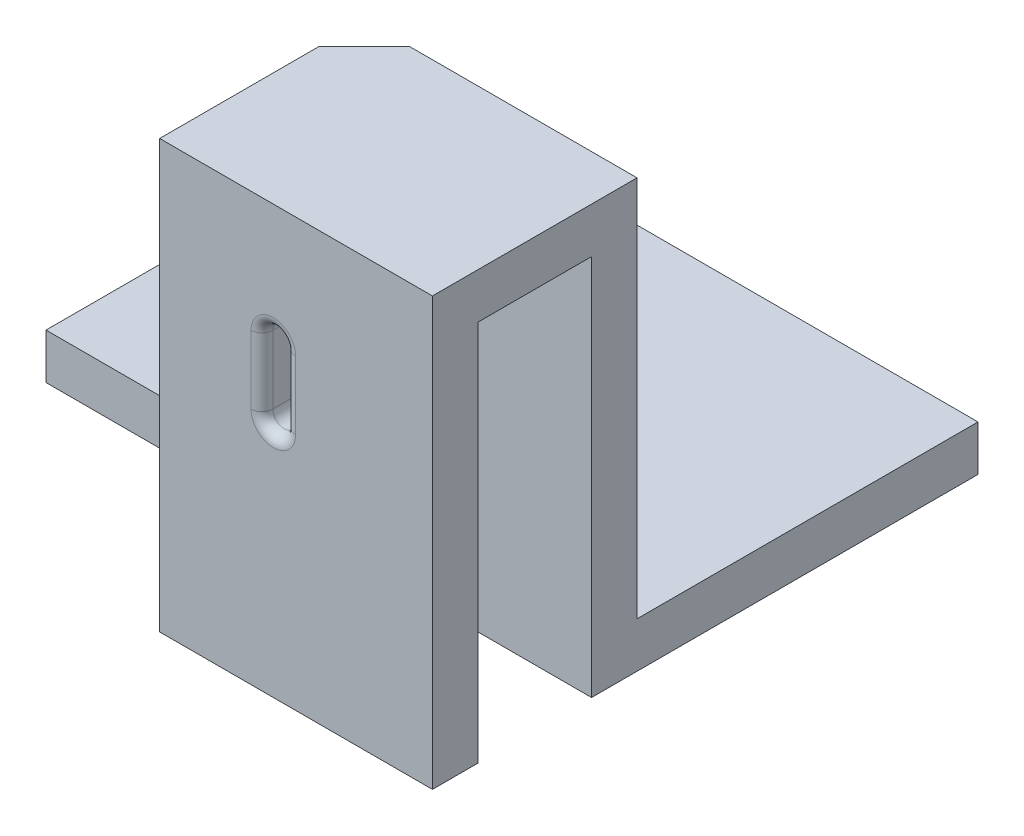
ISO-10303-21;
HEADER;
FILE_DESCRIPTION(('STEP AP214'),'2;1');
FILE_NAME('part.step','',(''),(''),'','','');
FILE_SCHEMA(('AUTOMOTIVE_DESIGN { 1 0 10303 214 1 1 1 1 }'));
ENDSEC;
DATA;
#1=APPLICATION_CONTEXT('core data for automotive mechanical design processes');
#2=APPLICATION_PROTOCOL_DEFINITION('international standard','automotive_design',2000,#1);
#3=PRODUCT_CONTEXT('',#1,'mechanical');
#4=PRODUCT('Part','Part','',(#3));
#5=PRODUCT_RELATED_PRODUCT_CATEGORY('part','',(#4));
#6=PRODUCT_DEFINITION_FORMATION('','',#4);
#7=PRODUCT_DEFINITION_CONTEXT('part definition',#1,'design');
#8=PRODUCT_DEFINITION('design','',#6,#7);
#9=PRODUCT_DEFINITION_SHAPE('','',#8);
#10=(LENGTH_UNIT() NAMED_UNIT(*) SI_UNIT(.MILLI.,.METRE.));
#11=(NAMED_UNIT(*) PLANE_ANGLE_UNIT() SI_UNIT($,.RADIAN.));
#12=(NAMED_UNIT(*) SI_UNIT($,.STERADIAN.) SOLID_ANGLE_UNIT());
#13=UNCERTAINTY_MEASURE_WITH_UNIT(LENGTH_MEASURE(1.E-05),#10,'distance_accuracy_value','');
#14=(GEOMETRIC_REPRESENTATION_CONTEXT(3) GLOBAL_UNCERTAINTY_ASSIGNED_CONTEXT((#13)) GLOBAL_UNIT_ASSIGNED_CONTEXT((#10,
#11,#12)) REPRESENTATION_CONTEXT('',''));
#15=CARTESIAN_POINT('',(0.,0.,0.));
#16=DIRECTION('',(0.,0.,1.));
#17=DIRECTION('',(1.,0.,0.));
#18=AXIS2_PLACEMENT_3D('',#15,#16,#17);
#19=CARTESIAN_POINT('',(0.,0.,0.));
#20=DIRECTION('',(0.,-1.,0.));
#21=DIRECTION('',(0.,0.,-1.));
#22=AXIS2_PLACEMENT_3D('',#19,#20,#21);
#23=PLANE('',#22);
#24=DIRECTION('',(-1.,0.,0.));
#25=VECTOR('',#24,1.);
#26=CARTESIAN_POINT('',(19.05,0.,-11.1125));
#27=LINE('',#26,#25);
#28=CARTESIAN_POINT('',(38.1,0.,-11.1125));
#29=VERTEX_POINT('',#28);
#30=CARTESIAN_POINT('',(0.,0.,-11.1125));
#31=VERTEX_POINT('',#30);
#32=EDGE_CURVE('E323',#29,#31,#27,.T.);
#33=ORIENTED_EDGE('',*,*,#32,.T.);
#34=DIRECTION('',(0.,0.,1.));
#35=VECTOR('',#34,1.);
#36=CARTESIAN_POINT('',(0.,0.,0.));
#37=LINE('',#36,#35);
#38=CARTESIAN_POINT('',(0.,0.,-38.1));
#39=VERTEX_POINT('',#38);
#40=EDGE_CURVE('E206',#39,#31,#37,.T.);
#41=ORIENTED_EDGE('',*,*,#40,.F.);
#42=DIRECTION('',(-1.,0.,0.));
#43=VECTOR('',#42,1.);
#44=CARTESIAN_POINT('',(0.,0.,-38.1));
#45=LINE('',#44,#43);
#46=CARTESIAN_POINT('',(38.1,0.,-38.1));
#47=VERTEX_POINT('',#46);
#48=EDGE_CURVE('E214',#47,#39,#45,.T.);
#49=ORIENTED_EDGE('',*,*,#48,.F.);
#50=DIRECTION('',(0.,0.,-1.));
#51=VECTOR('',#50,1.);
#52=CARTESIAN_POINT('',(38.1,0.,0.));
#53=LINE('',#52,#51);
#54=EDGE_CURVE('E205',#29,#47,#53,.T.);
#55=ORIENTED_EDGE('',*,*,#54,.F.);
#56=EDGE_LOOP('',(#33,#41,#49,#55));
#57=FACE_BOUND('',#56,.T.);
#58=ADVANCED_FACE('F35',(#57),#23,.T.);
#59=CARTESIAN_POINT('',(0.,3.175,0.));
#60=DIRECTION('',(0.,-1.,0.));
#61=DIRECTION('',(0.,0.,-1.));
#62=AXIS2_PLACEMENT_3D('',#59,#60,#61);
#63=PLANE('',#62);
#64=DIRECTION('',(0.,0.,1.));
#65=VECTOR('',#64,1.);
#66=CARTESIAN_POINT('',(0.,3.175,0.));
#67=LINE('',#66,#65);
#68=CARTESIAN_POINT('',(0.,3.175,-38.1));
#69=VERTEX_POINT('',#68);
#70=CARTESIAN_POINT('',(0.,3.175,-11.1125));
#71=VERTEX_POINT('',#70);
#72=EDGE_CURVE('E217',#69,#71,#67,.T.);
#73=ORIENTED_EDGE('',*,*,#72,.T.);
#74=DIRECTION('',(-1.,0.,0.));
#75=VECTOR('',#74,1.);
#76=CARTESIAN_POINT('',(19.05,3.175,-11.1125));
#77=LINE('',#76,#75);
#78=CARTESIAN_POINT('',(22.225,3.175,-11.1125));
#79=VERTEX_POINT('',#78);
#80=EDGE_CURVE('E319',#79,#71,#77,.T.);
#81=ORIENTED_EDGE('',*,*,#80,.F.);
#82=DIRECTION('',(0.,0.,1.));
#83=VECTOR('',#82,1.);
#84=CARTESIAN_POINT('',(22.225,3.175,0.));
#85=LINE('',#84,#83);
#86=CARTESIAN_POINT('',(22.225,3.175,-14.2875));
#87=VERTEX_POINT('',#86);
#88=EDGE_CURVE('E354',#87,#79,#85,.T.);
#89=ORIENTED_EDGE('',*,*,#88,.F.);
#90=DIRECTION('',(-1.,0.,0.));
#91=VECTOR('',#90,1.);
#92=CARTESIAN_POINT('',(0.,3.175,-14.2875));
#93=LINE('',#92,#91);
#94=CARTESIAN_POINT('',(38.1,3.175,-14.2875));
#95=VERTEX_POINT('',#94);
#96=EDGE_CURVE('E349',#95,#87,#93,.T.);
#97=ORIENTED_EDGE('',*,*,#96,.F.);
#98=DIRECTION('',(0.,0.,-1.));
#99=VECTOR('',#98,1.);
#100=CARTESIAN_POINT('',(38.1,3.175,0.));
#101=LINE('',#100,#99);
#102=CARTESIAN_POINT('',(38.1,3.175,-38.1));
#103=VERTEX_POINT('',#102);
#104=EDGE_CURVE('E378',#95,#103,#101,.T.);
#105=ORIENTED_EDGE('',*,*,#104,.T.);
#106=DIRECTION('',(-1.,0.,0.));
#107=VECTOR('',#106,1.);
#108=CARTESIAN_POINT('',(0.,3.175,-38.1));
#109=LINE('',#108,#107);
#110=EDGE_CURVE('E221',#103,#69,#109,.T.);
#111=ORIENTED_EDGE('',*,*,#110,.T.);
#112=EDGE_LOOP('',(#73,#81,#89,#97,#105,#111));
#113=FACE_BOUND('',#112,.T.);
#114=ADVANCED_FACE('F383',(#113),#63,.F.);
#115=CARTESIAN_POINT('',(0.,3.175,0.));
#116=DIRECTION('',(1.,0.,0.));
#117=DIRECTION('',(0.,0.,-1.));
#118=AXIS2_PLACEMENT_3D('',#115,#116,#117);
#119=PLANE('',#118);
#120=ORIENTED_EDGE('',*,*,#40,.T.);
#121=DIRECTION('',(0.,1.,0.));
#122=VECTOR('',#121,1.);
#123=CARTESIAN_POINT('',(0.,0.,-11.1125));
#124=LINE('',#123,#122);
#125=EDGE_CURVE('E199',#31,#71,#124,.T.);
#126=ORIENTED_EDGE('',*,*,#125,.T.);
#127=ORIENTED_EDGE('',*,*,#72,.F.);
#128=DIRECTION('',(0.,-1.,0.));
#129=VECTOR('',#128,1.);
#130=CARTESIAN_POINT('',(0.,3.175,-38.1));
#131=LINE('',#130,#129);
#132=EDGE_CURVE('E218',#69,#39,#131,.T.);
#133=ORIENTED_EDGE('',*,*,#132,.T.);
#134=EDGE_LOOP('',(#120,#126,#127,#133));
#135=FACE_BOUND('',#134,.T.);
#136=ADVANCED_FACE('F391',(#135),#119,.F.);
#137=CARTESIAN_POINT('',(0.,3.175,0.));
#138=DIRECTION('',(0.,0.,-1.));
#139=DIRECTION('',(-1.,0.,0.));
#140=AXIS2_PLACEMENT_3D('',#137,#138,#139);
#141=PLANE('',#140);
#142=DIRECTION('',(0.,1.,0.));
#143=VECTOR('',#142,1.);
#144=CARTESIAN_POINT('',(28.54325,3.175,0.));
#145=LINE('',#144,#143);
#146=CARTESIAN_POINT('',(28.54325,21.43125,0.));
#147=VERTEX_POINT('',#146);
#148=CARTESIAN_POINT('',(28.54325,16.66875,0.));
#149=VERTEX_POINT('',#148);
#150=EDGE_CURVE('E249',#147,#149,#145,.F.);
#151=ORIENTED_EDGE('',*,*,#150,.T.);
#152=CARTESIAN_POINT('',(26.9875,16.66875,0.));
#153=DIRECTION('',(0.,0.,-1.));
#154=DIRECTION('',(-1.,0.,0.));
#155=AXIS2_PLACEMENT_3D('',#152,#153,#154);
#156=CIRCLE('',#155,1.55575);
#157=CARTESIAN_POINT('',(25.43175,16.66875,0.));
#158=VERTEX_POINT('',#157);
#159=EDGE_CURVE('E254',#149,#158,#156,.T.);
#160=ORIENTED_EDGE('',*,*,#159,.T.);
#161=DIRECTION('',(0.,-1.,0.));
#162=VECTOR('',#161,1.);
#163=CARTESIAN_POINT('',(25.43175,3.175,0.));
#164=LINE('',#163,#162);
#165=CARTESIAN_POINT('',(25.43175,21.43125,0.));
#166=VERTEX_POINT('',#165);
#167=EDGE_CURVE('E59',#158,#166,#164,.F.);
#168=ORIENTED_EDGE('',*,*,#167,.T.);
#169=CARTESIAN_POINT('',(26.9875,21.43125,0.));
#170=DIRECTION('',(0.,0.,-1.));
#171=DIRECTION('',(-1.,0.,0.));
#172=AXIS2_PLACEMENT_3D('',#169,#170,#171);
#173=CIRCLE('',#172,1.55575);
#174=EDGE_CURVE('E251',#166,#147,#173,.T.);
#175=ORIENTED_EDGE('',*,*,#174,.T.);
#176=EDGE_LOOP('',(#151,#160,#168,#175));
#177=FACE_BOUND('',#176,.T.);
#178=DIRECTION('',(0.,-1.,0.));
#179=VECTOR('',#178,1.);
#180=CARTESIAN_POINT('',(19.05,26.67,0.));
#181=LINE('',#180,#179);
#182=CARTESIAN_POINT('',(19.05,29.845,0.));
#183=VERTEX_POINT('',#182);
#184=CARTESIAN_POINT('',(19.05,0.,0.));
#185=VERTEX_POINT('',#184);
#186=EDGE_CURVE('E178',#183,#185,#181,.T.);
#187=ORIENTED_EDGE('',*,*,#186,.T.);
#188=DIRECTION('',(1.,0.,0.));
#189=VECTOR('',#188,1.);
#190=CARTESIAN_POINT('',(0.,0.,0.));
#191=LINE('',#190,#189);
#192=CARTESIAN_POINT('',(38.1,0.,0.));
#193=VERTEX_POINT('',#192);
#194=EDGE_CURVE('E182',#185,#193,#191,.T.);
#195=ORIENTED_EDGE('',*,*,#194,.T.);
#196=DIRECTION('',(0.,-1.,0.));
#197=VECTOR('',#196,1.);
#198=CARTESIAN_POINT('',(38.1,3.175,0.));
#199=LINE('',#198,#197);
#200=CARTESIAN_POINT('',(38.1,29.845,0.));
#201=VERTEX_POINT('',#200);
#202=EDGE_CURVE('E224',#201,#193,#199,.T.);
#203=ORIENTED_EDGE('',*,*,#202,.F.);
#204=DIRECTION('',(1.,0.,0.));
#205=VECTOR('',#204,1.);
#206=CARTESIAN_POINT('',(19.05,29.845,0.));
#207=LINE('',#206,#205);
#208=EDGE_CURVE('E185',#183,#201,#207,.T.);
#209=ORIENTED_EDGE('',*,*,#208,.F.);
#210=EDGE_LOOP('',(#187,#195,#203,#209));
#211=FACE_BOUND('',#210,.T.);
#212=ADVANCED_FACE('F180',(#177,#211),#141,.F.);
#213=CARTESIAN_POINT('',(38.1,3.175,0.));
#214=DIRECTION('',(-1.,0.,0.));
#215=DIRECTION('',(0.,0.,1.));
#216=AXIS2_PLACEMENT_3D('',#213,#214,#215);
#217=PLANE('',#216);
#218=DIRECTION('',(0.,-1.,0.));
#219=VECTOR('',#218,1.);
#220=CARTESIAN_POINT('',(38.1,26.67,-11.1125));
#221=LINE('',#220,#219);
#222=CARTESIAN_POINT('',(38.1,26.67,-11.1125));
#223=VERTEX_POINT('',#222);
#224=EDGE_CURVE('E357',#223,#29,#221,.T.);
#225=ORIENTED_EDGE('',*,*,#224,.T.);
#226=ORIENTED_EDGE('',*,*,#54,.T.);
#227=DIRECTION('',(0.,-1.,0.));
#228=VECTOR('',#227,1.);
#229=CARTESIAN_POINT('',(38.1,3.175,-38.1));
#230=LINE('',#229,#228);
#231=EDGE_CURVE('E220',#103,#47,#230,.T.);
#232=ORIENTED_EDGE('',*,*,#231,.F.);
#233=ORIENTED_EDGE('',*,*,#104,.F.);
#234=DIRECTION('',(0.,-1.,0.));
#235=VECTOR('',#234,1.);
#236=CARTESIAN_POINT('',(38.1,26.67,-14.2875));
#237=LINE('',#236,#235);
#238=CARTESIAN_POINT('',(38.1,29.845,-14.2875));
#239=VERTEX_POINT('',#238);
#240=EDGE_CURVE('E369',#239,#95,#237,.T.);
#241=ORIENTED_EDGE('',*,*,#240,.F.);
#242=DIRECTION('',(0.,0.,-1.));
#243=VECTOR('',#242,1.);
#244=CARTESIAN_POINT('',(38.1,29.845,-14.2875));
#245=LINE('',#244,#243);
#246=EDGE_CURVE('E327',#201,#239,#245,.T.);
#247=ORIENTED_EDGE('',*,*,#246,.F.);
#248=ORIENTED_EDGE('',*,*,#202,.T.);
#249=CARTESIAN_POINT('',(38.1,0.,-3.175));
#250=VERTEX_POINT('',#249);
#251=EDGE_CURVE('E204',#193,#250,#53,.T.);
#252=ORIENTED_EDGE('',*,*,#251,.T.);
#253=DIRECTION('',(0.,-1.,0.));
#254=VECTOR('',#253,1.);
#255=CARTESIAN_POINT('',(38.1,26.67,-3.175));
#256=LINE('',#255,#254);
#257=CARTESIAN_POINT('',(38.1,26.67,-3.175));
#258=VERTEX_POINT('',#257);
#259=EDGE_CURVE('E210',#258,#250,#256,.T.);
#260=ORIENTED_EDGE('',*,*,#259,.F.);
#261=DIRECTION('',(0.,0.,-1.));
#262=VECTOR('',#261,1.);
#263=CARTESIAN_POINT('',(38.1,26.67,-14.2875));
#264=LINE('',#263,#262);
#265=EDGE_CURVE('E325',#258,#223,#264,.T.);
#266=ORIENTED_EDGE('',*,*,#265,.T.);
#267=EDGE_LOOP('',(#225,#226,#232,#233,#241,#247,#248,#252,#260,#266));
#268=FACE_BOUND('',#267,.T.);
#269=ADVANCED_FACE('F419',(#268),#217,.F.);
#270=CARTESIAN_POINT('',(0.,3.175,-38.1));
#271=DIRECTION('',(0.,0.,1.));
#272=DIRECTION('',(1.,0.,0.));
#273=AXIS2_PLACEMENT_3D('',#270,#271,#272);
#274=PLANE('',#273);
#275=ORIENTED_EDGE('',*,*,#132,.F.);
#276=ORIENTED_EDGE('',*,*,#110,.F.);
#277=ORIENTED_EDGE('',*,*,#231,.T.);
#278=ORIENTED_EDGE('',*,*,#48,.T.);
#279=EDGE_LOOP('',(#275,#276,#277,#278));
#280=FACE_BOUND('',#279,.T.);
#281=ADVANCED_FACE('F387',(#280),#274,.F.);
#282=DIRECTION('',(0.,0.,-1.));
#283=VECTOR('',#282,1.);
#284=CARTESIAN_POINT('',(19.05,0.,0.));
#285=LINE('',#284,#283);
#286=CARTESIAN_POINT('',(19.05,0.,-3.175));
#287=VERTEX_POINT('',#286);
#288=EDGE_CURVE('E193',#185,#287,#285,.T.);
#289=ORIENTED_EDGE('',*,*,#288,.T.);
#290=DIRECTION('',(1.,0.,0.));
#291=VECTOR('',#290,1.);
#292=CARTESIAN_POINT('',(19.05,0.,-3.175));
#293=LINE('',#292,#291);
#294=EDGE_CURVE('E321',#287,#250,#293,.T.);
#295=ORIENTED_EDGE('',*,*,#294,.T.);
#296=ORIENTED_EDGE('',*,*,#251,.F.);
#297=ORIENTED_EDGE('',*,*,#194,.F.);
#298=EDGE_LOOP('',(#289,#295,#296,#297));
#299=FACE_BOUND('',#298,.T.);
#300=ADVANCED_FACE('F202',(#299),#23,.T.);
#301=CARTESIAN_POINT('',(0.,26.67,-3.175));
#302=DIRECTION('',(0.,0.,1.));
#303=DIRECTION('',(1.,0.,0.));
#304=AXIS2_PLACEMENT_3D('',#301,#302,#303);
#305=PLANE('',#304);
#306=DIRECTION('',(0.,1.,0.));
#307=VECTOR('',#306,1.);
#308=CARTESIAN_POINT('',(25.43175,26.67,-3.175));
#309=LINE('',#308,#307);
#310=CARTESIAN_POINT('',(25.43175,21.43125,-3.175));
#311=VERTEX_POINT('',#310);
#312=CARTESIAN_POINT('',(25.43175,16.66875,-3.175));
#313=VERTEX_POINT('',#312);
#314=EDGE_CURVE('E232',#311,#313,#309,.F.);
#315=ORIENTED_EDGE('',*,*,#314,.T.);
#316=CARTESIAN_POINT('',(26.9875,16.66875,-3.175));
#317=DIRECTION('',(0.,0.,1.));
#318=DIRECTION('',(1.,0.,0.));
#319=AXIS2_PLACEMENT_3D('',#316,#317,#318);
#320=CIRCLE('',#319,1.55575);
#321=CARTESIAN_POINT('',(28.54325,16.66875,-3.175));
#322=VERTEX_POINT('',#321);
#323=EDGE_CURVE('E238',#313,#322,#320,.T.);
#324=ORIENTED_EDGE('',*,*,#323,.T.);
#325=DIRECTION('',(0.,-1.,0.));
#326=VECTOR('',#325,1.);
#327=CARTESIAN_POINT('',(28.54325,26.67,-3.175));
#328=LINE('',#327,#326);
#329=CARTESIAN_POINT('',(28.54325,21.43125,-3.175));
#330=VERTEX_POINT('',#329);
#331=EDGE_CURVE('E236',#322,#330,#328,.F.);
#332=ORIENTED_EDGE('',*,*,#331,.T.);
#333=CARTESIAN_POINT('',(26.9875,21.43125,-3.175));
#334=DIRECTION('',(0.,0.,1.));
#335=DIRECTION('',(1.,0.,0.));
#336=AXIS2_PLACEMENT_3D('',#333,#334,#335);
#337=CIRCLE('',#336,1.55575);
#338=EDGE_CURVE('E234',#330,#311,#337,.T.);
#339=ORIENTED_EDGE('',*,*,#338,.T.);
#340=EDGE_LOOP('',(#315,#324,#332,#339));
#341=FACE_BOUND('',#340,.T.);
#342=ORIENTED_EDGE('',*,*,#259,.T.);
#343=ORIENTED_EDGE('',*,*,#294,.F.);
#344=DIRECTION('',(0.,-1.,0.));
#345=VECTOR('',#344,1.);
#346=CARTESIAN_POINT('',(19.05,26.67,-3.175));
#347=LINE('',#346,#345);
#348=CARTESIAN_POINT('',(19.05,26.67,-3.175));
#349=VERTEX_POINT('',#348);
#350=EDGE_CURVE('E189',#349,#287,#347,.T.);
#351=ORIENTED_EDGE('',*,*,#350,.F.);
#352=DIRECTION('',(-1.,0.,0.));
#353=VECTOR('',#352,1.);
#354=CARTESIAN_POINT('',(0.,26.67,-3.175));
#355=LINE('',#354,#353);
#356=EDGE_CURVE('E190',#258,#349,#355,.T.);
#357=ORIENTED_EDGE('',*,*,#356,.F.);
#358=EDGE_LOOP('',(#342,#343,#351,#357));
#359=FACE_BOUND('',#358,.T.);
#360=ADVANCED_FACE('F429',(#341,#359),#305,.F.);
#361=CARTESIAN_POINT('',(19.05,26.67,0.));
#362=DIRECTION('',(1.,0.,0.));
#363=DIRECTION('',(0.,0.,-1.));
#364=AXIS2_PLACEMENT_3D('',#361,#362,#363);
#365=PLANE('',#364);
#366=DIRECTION('',(0.,0.,1.));
#367=VECTOR('',#366,1.);
#368=CARTESIAN_POINT('',(19.05,26.67,-11.1125));
#369=LINE('',#368,#367);
#370=CARTESIAN_POINT('',(19.05,26.67,-11.1125));
#371=VERTEX_POINT('',#370);
#372=EDGE_CURVE('E331',#371,#349,#369,.T.);
#373=ORIENTED_EDGE('',*,*,#372,.T.);
#374=ORIENTED_EDGE('',*,*,#350,.T.);
#375=ORIENTED_EDGE('',*,*,#288,.F.);
#376=ORIENTED_EDGE('',*,*,#186,.F.);
#377=DIRECTION('',(0.,0.,1.));
#378=VECTOR('',#377,1.);
#379=CARTESIAN_POINT('',(19.05,29.845,-11.1125));
#380=LINE('',#379,#378);
#381=CARTESIAN_POINT('',(19.05,29.845,-11.1125));
#382=VERTEX_POINT('',#381);
#383=EDGE_CURVE('E335',#382,#183,#380,.T.);
#384=ORIENTED_EDGE('',*,*,#383,.F.);
#385=DIRECTION('',(0.,-1.,0.));
#386=VECTOR('',#385,1.);
#387=CARTESIAN_POINT('',(19.05,29.845,-11.1125));
#388=LINE('',#387,#386);
#389=EDGE_CURVE('E338',#382,#371,#388,.T.);
#390=ORIENTED_EDGE('',*,*,#389,.T.);
#391=EDGE_LOOP('',(#373,#374,#375,#376,#384,#390));
#392=FACE_BOUND('',#391,.T.);
#393=ADVANCED_FACE('F195',(#392),#365,.F.);
#394=CARTESIAN_POINT('',(0.,26.67,-14.2875));
#395=DIRECTION('',(0.,0.,1.));
#396=DIRECTION('',(1.,0.,0.));
#397=AXIS2_PLACEMENT_3D('',#394,#395,#396);
#398=PLANE('',#397);
#399=CARTESIAN_POINT('',(26.9875,19.05,-14.2875));
#400=DIRECTION('',(0.,0.,1.));
#401=DIRECTION('',(1.,0.,0.));
#402=AXIS2_PLACEMENT_3D('',#399,#400,#401);
#403=CIRCLE('',#402,1.55575);
#404=CARTESIAN_POINT('',(28.54325,19.05,-14.2875));
#405=VERTEX_POINT('',#404);
#406=EDGE_CURVE('E11',#405,#405,#403,.T.);
#407=ORIENTED_EDGE('',*,*,#406,.T.);
#408=EDGE_LOOP('',(#407));
#409=FACE_BOUND('',#408,.T.);
#410=ORIENTED_EDGE('',*,*,#96,.T.);
#411=DIRECTION('',(0.,-1.,0.));
#412=VECTOR('',#411,1.);
#413=CARTESIAN_POINT('',(22.225,26.67,-14.2875));
#414=LINE('',#413,#412);
#415=CARTESIAN_POINT('',(22.225,26.67,-14.2875));
#416=VERTEX_POINT('',#415);
#417=EDGE_CURVE('E366',#416,#87,#414,.T.);
#418=ORIENTED_EDGE('',*,*,#417,.F.);
#419=DIRECTION('',(0.,-1.,0.));
#420=VECTOR('',#419,1.);
#421=CARTESIAN_POINT('',(22.225,29.845,-14.2875));
#422=LINE('',#421,#420);
#423=CARTESIAN_POINT('',(22.225,29.845,-14.2875));
#424=VERTEX_POINT('',#423);
#425=EDGE_CURVE('E346',#424,#416,#422,.T.);
#426=ORIENTED_EDGE('',*,*,#425,.F.);
#427=DIRECTION('',(-1.,0.,0.));
#428=VECTOR('',#427,1.);
#429=CARTESIAN_POINT('',(38.1,29.845,-14.2875));
#430=LINE('',#429,#428);
#431=EDGE_CURVE('E330',#239,#424,#430,.T.);
#432=ORIENTED_EDGE('',*,*,#431,.F.);
#433=ORIENTED_EDGE('',*,*,#240,.T.);
#434=EDGE_LOOP('',(#410,#418,#426,#432,#433));
#435=FACE_BOUND('',#434,.T.);
#436=ADVANCED_FACE('F404',(#409,#435),#398,.F.);
#437=CARTESIAN_POINT('',(22.225,26.67,0.));
#438=DIRECTION('',(1.,0.,0.));
#439=DIRECTION('',(0.,0.,-1.));
#440=AXIS2_PLACEMENT_3D('',#437,#438,#439);
#441=PLANE('',#440);
#442=ORIENTED_EDGE('',*,*,#88,.T.);
#443=DIRECTION('',(0.,-1.,0.));
#444=VECTOR('',#443,1.);
#445=CARTESIAN_POINT('',(22.225,26.67,-11.1125));
#446=LINE('',#445,#444);
#447=CARTESIAN_POINT('',(22.225,26.67,-11.1125));
#448=VERTEX_POINT('',#447);
#449=EDGE_CURVE('E363',#448,#79,#446,.T.);
#450=ORIENTED_EDGE('',*,*,#449,.F.);
#451=DIRECTION('',(0.,0.,1.));
#452=VECTOR('',#451,1.);
#453=CARTESIAN_POINT('',(22.225,26.67,0.));
#454=LINE('',#453,#452);
#455=EDGE_CURVE('E350',#416,#448,#454,.T.);
#456=ORIENTED_EDGE('',*,*,#455,.F.);
#457=ORIENTED_EDGE('',*,*,#417,.T.);
#458=EDGE_LOOP('',(#442,#450,#456,#457));
#459=FACE_BOUND('',#458,.T.);
#460=ADVANCED_FACE('F400',(#459),#441,.F.);
#461=CARTESIAN_POINT('',(0.,26.67,-11.1125));
#462=DIRECTION('',(0.,0.,-1.));
#463=DIRECTION('',(-1.,0.,0.));
#464=AXIS2_PLACEMENT_3D('',#461,#462,#463);
#465=PLANE('',#464);
#466=CARTESIAN_POINT('',(26.9875,19.05,-11.1125));
#467=DIRECTION('',(0.,0.,-1.));
#468=DIRECTION('',(-1.,0.,0.));
#469=AXIS2_PLACEMENT_3D('',#466,#467,#468);
#470=CIRCLE('',#469,1.55575);
#471=CARTESIAN_POINT('',(25.43175,19.05,-11.1125));
#472=VERTEX_POINT('',#471);
#473=EDGE_CURVE('E260',#472,#472,#470,.T.);
#474=ORIENTED_EDGE('',*,*,#473,.T.);
#475=EDGE_LOOP('',(#474));
#476=FACE_BOUND('',#475,.T.);
#477=ORIENTED_EDGE('',*,*,#449,.T.);
#478=ORIENTED_EDGE('',*,*,#80,.T.);
#479=ORIENTED_EDGE('',*,*,#125,.F.);
#480=ORIENTED_EDGE('',*,*,#32,.F.);
#481=ORIENTED_EDGE('',*,*,#224,.F.);
#482=DIRECTION('',(1.,0.,0.));
#483=VECTOR('',#482,1.);
#484=CARTESIAN_POINT('',(0.,26.67,-11.1125));
#485=LINE('',#484,#483);
#486=EDGE_CURVE('E353',#448,#223,#485,.T.);
#487=ORIENTED_EDGE('',*,*,#486,.F.);
#488=EDGE_LOOP('',(#477,#478,#479,#480,#481,#487));
#489=FACE_BOUND('',#488,.T.);
#490=ADVANCED_FACE('F396',(#476,#489),#465,.F.);
#491=CARTESIAN_POINT('',(0.,26.67,0.));
#492=DIRECTION('',(0.,1.,0.));
#493=DIRECTION('',(0.,0.,1.));
#494=AXIS2_PLACEMENT_3D('',#491,#492,#493);
#495=PLANE('',#494);
#496=ORIENTED_EDGE('',*,*,#265,.F.);
#497=ORIENTED_EDGE('',*,*,#356,.T.);
#498=ORIENTED_EDGE('',*,*,#372,.F.);
#499=DIRECTION('',(-0.707106781186548,0.,0.707106781186547));
#500=VECTOR('',#499,1.);
#501=CARTESIAN_POINT('',(22.225,26.67,-14.2875));
#502=LINE('',#501,#500);
#503=EDGE_CURVE('E341',#416,#371,#502,.T.);
#504=ORIENTED_EDGE('',*,*,#503,.F.);
#505=ORIENTED_EDGE('',*,*,#455,.T.);
#506=ORIENTED_EDGE('',*,*,#486,.T.);
#507=EDGE_LOOP('',(#496,#497,#498,#504,#505,#506));
#508=FACE_BOUND('',#507,.T.);
#509=ADVANCED_FACE('F414',(#508),#495,.F.);
#510=CARTESIAN_POINT('',(22.225,29.845,-14.2875));
#511=DIRECTION('',(0.707106781186547,0.,0.707106781186548));
#512=DIRECTION('',(0.707106781186548,0.,-0.707106781186547));
#513=AXIS2_PLACEMENT_3D('',#510,#511,#512);
#514=PLANE('',#513);
#515=ORIENTED_EDGE('',*,*,#503,.T.);
#516=ORIENTED_EDGE('',*,*,#389,.F.);
#517=DIRECTION('',(-0.707106781186548,0.,0.707106781186547));
#518=VECTOR('',#517,1.);
#519=CARTESIAN_POINT('',(22.225,29.845,-14.2875));
#520=LINE('',#519,#518);
#521=EDGE_CURVE('E333',#424,#382,#520,.T.);
#522=ORIENTED_EDGE('',*,*,#521,.F.);
#523=ORIENTED_EDGE('',*,*,#425,.T.);
#524=EDGE_LOOP('',(#515,#516,#522,#523));
#525=FACE_BOUND('',#524,.T.);
#526=ADVANCED_FACE('F409',(#525),#514,.F.);
#527=CARTESIAN_POINT('',(0.,29.845,0.));
#528=DIRECTION('',(0.,1.,0.));
#529=DIRECTION('',(0.,0.,1.));
#530=AXIS2_PLACEMENT_3D('',#527,#528,#529);
#531=PLANE('',#530);
#532=ORIENTED_EDGE('',*,*,#246,.T.);
#533=ORIENTED_EDGE('',*,*,#431,.T.);
#534=ORIENTED_EDGE('',*,*,#521,.T.);
#535=ORIENTED_EDGE('',*,*,#383,.T.);
#536=ORIENTED_EDGE('',*,*,#208,.T.);
#537=EDGE_LOOP('',(#532,#533,#534,#535,#536));
#538=FACE_BOUND('',#537,.T.);
#539=ADVANCED_FACE('F416',(#538),#531,.T.);
#540=CARTESIAN_POINT('',(26.9875,19.05,0.));
#541=DIRECTION('',(0.,0.,-1.));
#542=DIRECTION('',(-1.,0.,0.));
#543=AXIS2_PLACEMENT_3D('',#540,#541,#542);
#544=CYLINDRICAL_SURFACE('',#543,0.793749999999999);
#545=CARTESIAN_POINT('',(26.9875,19.05,-11.8745));
#546=DIRECTION('',(0.,0.,-1.));
#547=DIRECTION('',(-1.,0.,0.));
#548=AXIS2_PLACEMENT_3D('',#545,#546,#547);
#549=CIRCLE('',#548,0.793749999999999);
#550=CARTESIAN_POINT('',(26.19375,19.05,-11.8745));
#551=VERTEX_POINT('',#550);
#552=EDGE_CURVE('E44',#551,#551,#549,.F.);
#553=ORIENTED_EDGE('',*,*,#552,.T.);
#554=EDGE_LOOP('',(#553));
#555=FACE_BOUND('',#554,.T.);
#556=CARTESIAN_POINT('',(26.9875,19.05,-13.5255));
#557=DIRECTION('',(0.,0.,1.));
#558=DIRECTION('',(1.,0.,0.));
#559=AXIS2_PLACEMENT_3D('',#556,#557,#558);
#560=CIRCLE('',#559,0.793749999999999);
#561=CARTESIAN_POINT('',(27.78125,19.05,-13.5255));
#562=VERTEX_POINT('',#561);
#563=EDGE_CURVE('E263',#562,#562,#560,.F.);
#564=ORIENTED_EDGE('',*,*,#563,.T.);
#565=EDGE_LOOP('',(#564));
#566=FACE_BOUND('',#565,.T.);
#567=ADVANCED_FACE('F526',(#555,#566),#544,.F.);
#568=CARTESIAN_POINT('',(27.78125,16.66875,-38.101));
#569=DIRECTION('',(1.,0.,0.));
#570=DIRECTION('',(0.,0.,-1.));
#571=AXIS2_PLACEMENT_3D('',#568,#569,#570);
#572=PLANE('',#571);
#573=DIRECTION('',(0.,0.,1.));
#574=VECTOR('',#573,1.);
#575=CARTESIAN_POINT('',(27.78125,21.43125,-38.101));
#576=LINE('',#575,#574);
#577=CARTESIAN_POINT('',(27.78125,21.43125,-2.413));
#578=VERTEX_POINT('',#577);
#579=CARTESIAN_POINT('',(27.78125,21.43125,-0.761999999999999));
#580=VERTEX_POINT('',#579);
#581=EDGE_CURVE('E311',#578,#580,#576,.T.);
#582=ORIENTED_EDGE('',*,*,#581,.F.);
#583=DIRECTION('',(0.,-1.,0.));
#584=VECTOR('',#583,1.);
#585=CARTESIAN_POINT('',(27.78125,16.66875,-2.413));
#586=LINE('',#585,#584);
#587=CARTESIAN_POINT('',(27.78125,16.66875,-2.413));
#588=VERTEX_POINT('',#587);
#589=EDGE_CURVE('E243',#578,#588,#586,.T.);
#590=ORIENTED_EDGE('',*,*,#589,.T.);
#591=DIRECTION('',(0.,0.,1.));
#592=VECTOR('',#591,1.);
#593=CARTESIAN_POINT('',(27.78125,16.66875,-38.101));
#594=LINE('',#593,#592);
#595=CARTESIAN_POINT('',(27.78125,16.66875,-0.761999999999999));
#596=VERTEX_POINT('',#595);
#597=EDGE_CURVE('E306',#588,#596,#594,.T.);
#598=ORIENTED_EDGE('',*,*,#597,.T.);
#599=DIRECTION('',(0.,1.,0.));
#600=VECTOR('',#599,1.);
#601=CARTESIAN_POINT('',(27.78125,16.66875,-0.761999999999999));
#602=LINE('',#601,#600);
#603=EDGE_CURVE('E241',#596,#580,#602,.T.);
#604=ORIENTED_EDGE('',*,*,#603,.T.);
#605=EDGE_LOOP('',(#582,#590,#598,#604));
#606=FACE_BOUND('',#605,.T.);
#607=ADVANCED_FACE('F309',(#606),#572,.F.);
#608=CARTESIAN_POINT('',(26.9875,21.43125,-38.101));
#609=DIRECTION('',(0.,0.,1.));
#610=DIRECTION('',(1.,0.,0.));
#611=AXIS2_PLACEMENT_3D('',#608,#609,#610);
#612=CYLINDRICAL_SURFACE('',#611,0.793749999999999);
#613=DIRECTION('',(0.,0.,1.));
#614=VECTOR('',#613,1.);
#615=CARTESIAN_POINT('',(26.19375,21.43125,-38.101));
#616=LINE('',#615,#614);
#617=CARTESIAN_POINT('',(26.19375,21.43125,-2.413));
#618=VERTEX_POINT('',#617);
#619=CARTESIAN_POINT('',(26.19375,21.43125,-0.761999999999999));
#620=VERTEX_POINT('',#619);
#621=EDGE_CURVE('E313',#618,#620,#616,.T.);
#622=ORIENTED_EDGE('',*,*,#621,.F.);
#623=CARTESIAN_POINT('',(26.9875,21.43125,-2.413));
#624=DIRECTION('',(0.,0.,1.));
#625=DIRECTION('',(1.,0.,0.));
#626=AXIS2_PLACEMENT_3D('',#623,#624,#625);
#627=CIRCLE('',#626,0.793749999999999);
#628=EDGE_CURVE('E247',#618,#578,#627,.F.);
#629=ORIENTED_EDGE('',*,*,#628,.T.);
#630=ORIENTED_EDGE('',*,*,#581,.T.);
#631=CARTESIAN_POINT('',(26.9875,21.43125,-0.761999999999999));
#632=DIRECTION('',(0.,0.,-1.));
#633=DIRECTION('',(-1.,0.,0.));
#634=AXIS2_PLACEMENT_3D('',#631,#632,#633);
#635=CIRCLE('',#634,0.793749999999999);
#636=EDGE_CURVE('E245',#580,#620,#635,.F.);
#637=ORIENTED_EDGE('',*,*,#636,.T.);
#638=EDGE_LOOP('',(#622,#629,#630,#637));
#639=FACE_BOUND('',#638,.T.);
#640=ADVANCED_FACE('F620',(#639),#612,.F.);
#641=CARTESIAN_POINT('',(26.19375,16.66875,-38.101));
#642=DIRECTION('',(-1.,0.,0.));
#643=DIRECTION('',(0.,0.,1.));
#644=AXIS2_PLACEMENT_3D('',#641,#642,#643);
#645=PLANE('',#644);
#646=ORIENTED_EDGE('',*,*,#621,.T.);
#647=DIRECTION('',(0.,-1.,0.));
#648=VECTOR('',#647,1.);
#649=CARTESIAN_POINT('',(26.19375,16.66875,-0.761999999999999));
#650=LINE('',#649,#648);
#651=CARTESIAN_POINT('',(26.19375,16.66875,-0.761999999999999));
#652=VERTEX_POINT('',#651);
#653=EDGE_CURVE('E258',#620,#652,#650,.T.);
#654=ORIENTED_EDGE('',*,*,#653,.T.);
#655=DIRECTION('',(0.,0.,1.));
#656=VECTOR('',#655,1.);
#657=CARTESIAN_POINT('',(26.19375,16.66875,-38.101));
#658=LINE('',#657,#656);
#659=CARTESIAN_POINT('',(26.19375,16.66875,-2.413));
#660=VERTEX_POINT('',#659);
#661=EDGE_CURVE('E278',#660,#652,#658,.T.);
#662=ORIENTED_EDGE('',*,*,#661,.F.);
#663=DIRECTION('',(0.,1.,0.));
#664=VECTOR('',#663,1.);
#665=CARTESIAN_POINT('',(26.19375,16.66875,-2.413));
#666=LINE('',#665,#664);
#667=EDGE_CURVE('E256',#660,#618,#666,.T.);
#668=ORIENTED_EDGE('',*,*,#667,.T.);
#669=EDGE_LOOP('',(#646,#654,#662,#668));
#670=FACE_BOUND('',#669,.T.);
#671=ADVANCED_FACE('F631',(#670),#645,.F.);
#672=CARTESIAN_POINT('',(26.9875,16.66875,-38.101));
#673=DIRECTION('',(0.,0.,1.));
#674=DIRECTION('',(1.,0.,0.));
#675=AXIS2_PLACEMENT_3D('',#672,#673,#674);
#676=CYLINDRICAL_SURFACE('',#675,0.793749999999999);
#677=ORIENTED_EDGE('',*,*,#597,.F.);
#678=CARTESIAN_POINT('',(26.9875,16.66875,-2.413));
#679=DIRECTION('',(0.,0.,1.));
#680=DIRECTION('',(1.,0.,0.));
#681=AXIS2_PLACEMENT_3D('',#678,#679,#680);
#682=CIRCLE('',#681,0.793749999999999);
#683=EDGE_CURVE('E229',#588,#660,#682,.F.);
#684=ORIENTED_EDGE('',*,*,#683,.T.);
#685=ORIENTED_EDGE('',*,*,#661,.T.);
#686=CARTESIAN_POINT('',(26.9875,16.66875,-0.761999999999999));
#687=DIRECTION('',(0.,0.,-1.));
#688=DIRECTION('',(-1.,0.,0.));
#689=AXIS2_PLACEMENT_3D('',#686,#687,#688);
#690=CIRCLE('',#689,0.793749999999999);
#691=EDGE_CURVE('E226',#652,#596,#690,.F.);
#692=ORIENTED_EDGE('',*,*,#691,.T.);
#693=EDGE_LOOP('',(#677,#684,#685,#692));
#694=FACE_BOUND('',#693,.T.);
#695=ADVANCED_FACE('F305',(#694),#676,.F.);
#696=CARTESIAN_POINT('',(26.9875,21.43125,-2.413));
#697=DIRECTION('',(0.,0.,1.));
#698=DIRECTION('',(1.,0.,0.));
#699=AXIS2_PLACEMENT_3D('',#696,#697,#698);
#700=TOROIDAL_SURFACE('',#699,1.55575,0.762);
#701=CARTESIAN_POINT('',(25.43175,21.43125,-2.413));
#702=DIRECTION('',(0.,-1.,0.));
#703=DIRECTION('',(0.,0.,-1.));
#704=AXIS2_PLACEMENT_3D('',#701,#702,#703);
#705=CIRCLE('',#704,0.762);
#706=EDGE_CURVE('E272',#311,#618,#705,.T.);
#707=ORIENTED_EDGE('',*,*,#706,.F.);
#708=ORIENTED_EDGE('',*,*,#338,.F.);
#709=CARTESIAN_POINT('',(28.54325,21.43125,-2.413));
#710=DIRECTION('',(0.,-1.,0.));
#711=DIRECTION('',(0.,0.,-1.));
#712=AXIS2_PLACEMENT_3D('',#709,#710,#711);
#713=CIRCLE('',#712,0.762);
#714=EDGE_CURVE('E275',#578,#330,#713,.T.);
#715=ORIENTED_EDGE('',*,*,#714,.F.);
#716=ORIENTED_EDGE('',*,*,#628,.F.);
#717=EDGE_LOOP('',(#707,#708,#715,#716));
#718=FACE_BOUND('',#717,.T.);
#719=ADVANCED_FACE('F456',(#718),#700,.T.);
#720=CARTESIAN_POINT('',(28.54325,16.66875,-2.413));
#721=DIRECTION('',(0.,-1.,0.));
#722=DIRECTION('',(0.,0.,-1.));
#723=AXIS2_PLACEMENT_3D('',#720,#721,#722);
#724=CYLINDRICAL_SURFACE('',#723,0.762);
#725=ORIENTED_EDGE('',*,*,#714,.T.);
#726=ORIENTED_EDGE('',*,*,#331,.F.);
#727=CARTESIAN_POINT('',(28.54325,16.66875,-2.413));
#728=DIRECTION('',(0.,-1.,0.));
#729=DIRECTION('',(0.,0.,-1.));
#730=AXIS2_PLACEMENT_3D('',#727,#728,#729);
#731=CIRCLE('',#730,0.762);
#732=EDGE_CURVE('E270',#588,#322,#731,.T.);
#733=ORIENTED_EDGE('',*,*,#732,.F.);
#734=ORIENTED_EDGE('',*,*,#589,.F.);
#735=EDGE_LOOP('',(#725,#726,#733,#734));
#736=FACE_BOUND('',#735,.T.);
#737=ADVANCED_FACE('F452',(#736),#724,.T.);
#738=CARTESIAN_POINT('',(25.43175,16.66875,-2.413));
#739=DIRECTION('',(0.,1.,0.));
#740=DIRECTION('',(0.,0.,1.));
#741=AXIS2_PLACEMENT_3D('',#738,#739,#740);
#742=CYLINDRICAL_SURFACE('',#741,0.762);
#743=ORIENTED_EDGE('',*,*,#706,.T.);
#744=ORIENTED_EDGE('',*,*,#667,.F.);
#745=CARTESIAN_POINT('',(25.43175,16.66875,-2.413));
#746=DIRECTION('',(0.,-1.,0.));
#747=DIRECTION('',(0.,0.,-1.));
#748=AXIS2_PLACEMENT_3D('',#745,#746,#747);
#749=CIRCLE('',#748,0.762);
#750=EDGE_CURVE('E268',#313,#660,#749,.T.);
#751=ORIENTED_EDGE('',*,*,#750,.F.);
#752=ORIENTED_EDGE('',*,*,#314,.F.);
#753=EDGE_LOOP('',(#743,#744,#751,#752));
#754=FACE_BOUND('',#753,.T.);
#755=ADVANCED_FACE('F448',(#754),#742,.T.);
#756=CARTESIAN_POINT('',(26.9875,16.66875,-2.413));
#757=DIRECTION('',(0.,0.,1.));
#758=DIRECTION('',(1.,0.,0.));
#759=AXIS2_PLACEMENT_3D('',#756,#757,#758);
#760=TOROIDAL_SURFACE('',#759,1.55575,0.762);
#761=ORIENTED_EDGE('',*,*,#732,.T.);
#762=ORIENTED_EDGE('',*,*,#323,.F.);
#763=ORIENTED_EDGE('',*,*,#750,.T.);
#764=ORIENTED_EDGE('',*,*,#683,.F.);
#765=EDGE_LOOP('',(#761,#762,#763,#764));
#766=FACE_BOUND('',#765,.T.);
#767=ADVANCED_FACE('F445',(#766),#760,.T.);
#768=CARTESIAN_POINT('',(26.9875,21.43125,-0.761999999999999));
#769=DIRECTION('',(0.,0.,-1.));
#770=DIRECTION('',(-1.,0.,0.));
#771=AXIS2_PLACEMENT_3D('',#768,#769,#770);
#772=TOROIDAL_SURFACE('',#771,1.55575,0.762);
#773=CARTESIAN_POINT('',(28.54325,21.43125,-0.762));
#774=DIRECTION('',(0.,-1.,0.));
#775=DIRECTION('',(0.,0.,-1.));
#776=AXIS2_PLACEMENT_3D('',#773,#774,#775);
#777=CIRCLE('',#776,0.762);
#778=EDGE_CURVE('E281',#147,#580,#777,.T.);
#779=ORIENTED_EDGE('',*,*,#778,.F.);
#780=ORIENTED_EDGE('',*,*,#174,.F.);
#781=CARTESIAN_POINT('',(25.43175,21.43125,-0.761999999999999));
#782=DIRECTION('',(0.,-1.,0.));
#783=DIRECTION('',(0.,0.,-1.));
#784=AXIS2_PLACEMENT_3D('',#781,#782,#783);
#785=CIRCLE('',#784,0.762);
#786=EDGE_CURVE('E39',#620,#166,#785,.T.);
#787=ORIENTED_EDGE('',*,*,#786,.F.);
#788=ORIENTED_EDGE('',*,*,#636,.F.);
#789=EDGE_LOOP('',(#779,#780,#787,#788));
#790=FACE_BOUND('',#789,.T.);
#791=ADVANCED_FACE('F294',(#790),#772,.T.);
#792=CARTESIAN_POINT('',(25.43175,16.66875,-0.761999999999999));
#793=DIRECTION('',(0.,-1.,0.));
#794=DIRECTION('',(0.,0.,-1.));
#795=AXIS2_PLACEMENT_3D('',#792,#793,#794);
#796=CYLINDRICAL_SURFACE('',#795,0.762);
#797=ORIENTED_EDGE('',*,*,#786,.T.);
#798=ORIENTED_EDGE('',*,*,#167,.F.);
#799=CARTESIAN_POINT('',(25.43175,16.66875,-0.761999999999999));
#800=DIRECTION('',(0.,-1.,0.));
#801=DIRECTION('',(0.,0.,-1.));
#802=AXIS2_PLACEMENT_3D('',#799,#800,#801);
#803=CIRCLE('',#802,0.762);
#804=EDGE_CURVE('E52',#652,#158,#803,.T.);
#805=ORIENTED_EDGE('',*,*,#804,.F.);
#806=ORIENTED_EDGE('',*,*,#653,.F.);
#807=EDGE_LOOP('',(#797,#798,#805,#806));
#808=FACE_BOUND('',#807,.T.);
#809=ADVANCED_FACE('F291',(#808),#796,.T.);
#810=CARTESIAN_POINT('',(28.54325,16.66875,-0.761999999999999));
#811=DIRECTION('',(0.,1.,0.));
#812=DIRECTION('',(0.,0.,1.));
#813=AXIS2_PLACEMENT_3D('',#810,#811,#812);
#814=CYLINDRICAL_SURFACE('',#813,0.762);
#815=ORIENTED_EDGE('',*,*,#778,.T.);
#816=ORIENTED_EDGE('',*,*,#603,.F.);
#817=CARTESIAN_POINT('',(28.54325,16.66875,-0.762));
#818=DIRECTION('',(0.,-1.,0.));
#819=DIRECTION('',(0.,0.,-1.));
#820=AXIS2_PLACEMENT_3D('',#817,#818,#819);
#821=CIRCLE('',#820,0.762);
#822=EDGE_CURVE('E279',#149,#596,#821,.T.);
#823=ORIENTED_EDGE('',*,*,#822,.F.);
#824=ORIENTED_EDGE('',*,*,#150,.F.);
#825=EDGE_LOOP('',(#815,#816,#823,#824));
#826=FACE_BOUND('',#825,.T.);
#827=ADVANCED_FACE('F297',(#826),#814,.T.);
#828=CARTESIAN_POINT('',(26.9875,16.66875,-0.761999999999999));
#829=DIRECTION('',(0.,0.,-1.));
#830=DIRECTION('',(-1.,0.,0.));
#831=AXIS2_PLACEMENT_3D('',#828,#829,#830);
#832=TOROIDAL_SURFACE('',#831,1.55575,0.762);
#833=ORIENTED_EDGE('',*,*,#804,.T.);
#834=ORIENTED_EDGE('',*,*,#159,.F.);
#835=ORIENTED_EDGE('',*,*,#822,.T.);
#836=ORIENTED_EDGE('',*,*,#691,.F.);
#837=EDGE_LOOP('',(#833,#834,#835,#836));
#838=FACE_BOUND('',#837,.T.);
#839=ADVANCED_FACE('F296',(#838),#832,.T.);
#840=CARTESIAN_POINT('',(26.9875,19.05,-11.8745));
#841=DIRECTION('',(0.,0.,-1.));
#842=DIRECTION('',(-1.,0.,0.));
#843=AXIS2_PLACEMENT_3D('',#840,#841,#842);
#844=TOROIDAL_SURFACE('',#843,1.55575,0.762);
#845=ORIENTED_EDGE('',*,*,#552,.F.);
#846=EDGE_LOOP('',(#845));
#847=FACE_BOUND('',#846,.T.);
#848=ORIENTED_EDGE('',*,*,#473,.F.);
#849=EDGE_LOOP('',(#848));
#850=FACE_BOUND('',#849,.T.);
#851=ADVANCED_FACE('F463',(#847,#850),#844,.T.);
#852=CARTESIAN_POINT('',(26.9875,19.05,-13.5255));
#853=DIRECTION('',(0.,0.,1.));
#854=DIRECTION('',(1.,0.,0.));
#855=AXIS2_PLACEMENT_3D('',#852,#853,#854);
#856=TOROIDAL_SURFACE('',#855,1.55575,0.762);
#857=ORIENTED_EDGE('',*,*,#406,.F.);
#858=EDGE_LOOP('',(#857));
#859=FACE_BOUND('',#858,.T.);
#860=ORIENTED_EDGE('',*,*,#563,.F.);
#861=EDGE_LOOP('',(#860));
#862=FACE_BOUND('',#861,.T.);
#863=ADVANCED_FACE('F37',(#859,#862),#856,.T.);
#864=CLOSED_SHELL('',(#58,#114,#136,#212,#269,#281,#300,#360,#393,#436,#460,#490,#509,#526,#539,
#567,#607,#640,#671,#695,#719,#737,#755,#767,#791,#809,#827,#839,#851,#863));
#865=MANIFOLD_SOLID_BREP('B2',#864);
#866=ADVANCED_BREP_SHAPE_REPRESENTATION('',(#18,#865),#14);
#867=SHAPE_DEFINITION_REPRESENTATION(#9,#866);
ENDSEC;
END-ISO-10303-21;
